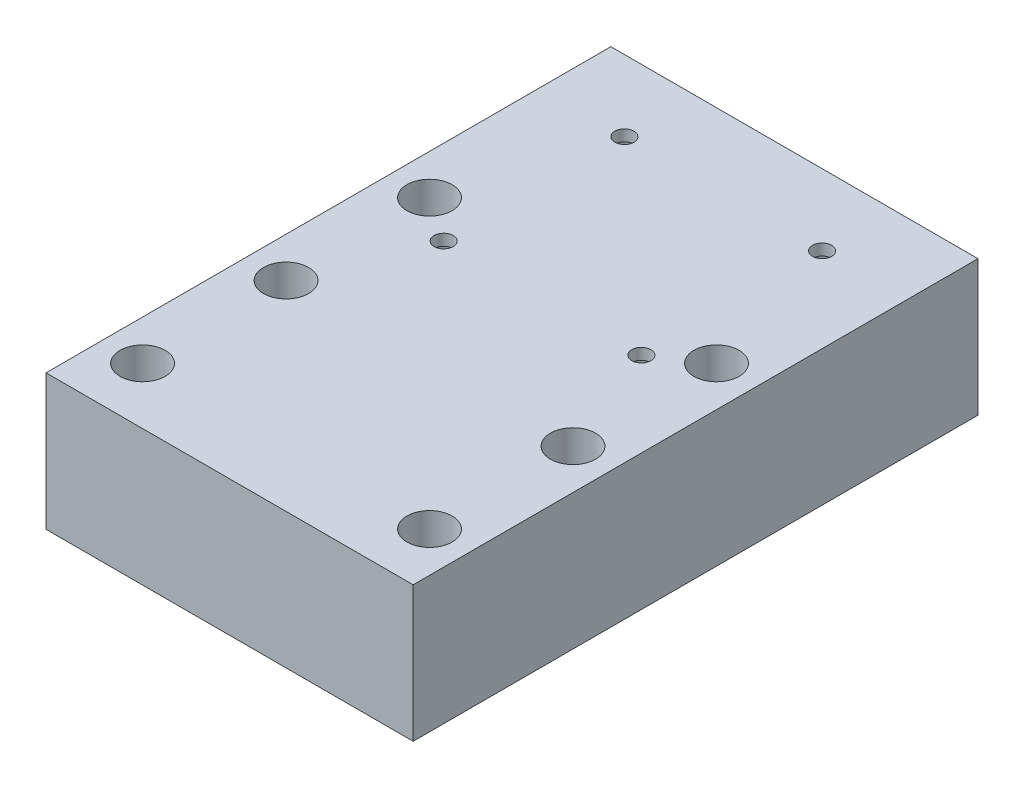
ISO-10303-21;
HEADER;
FILE_DESCRIPTION(('STEP AP214'),'2;1');
FILE_NAME('part.step','',(''),(''),'','','');
FILE_SCHEMA(('AUTOMOTIVE_DESIGN { 1 0 10303 214 1 1 1 1 }'));
ENDSEC;
DATA;
#1=APPLICATION_CONTEXT('core data for automotive mechanical design processes');
#2=APPLICATION_PROTOCOL_DEFINITION('international standard','automotive_design',2000,#1);
#3=PRODUCT_CONTEXT('',#1,'mechanical');
#4=PRODUCT('Part','Part','',(#3));
#5=PRODUCT_RELATED_PRODUCT_CATEGORY('part','',(#4));
#6=PRODUCT_DEFINITION_FORMATION('','',#4);
#7=PRODUCT_DEFINITION_CONTEXT('part definition',#1,'design');
#8=PRODUCT_DEFINITION('design','',#6,#7);
#9=PRODUCT_DEFINITION_SHAPE('','',#8);
#10=(LENGTH_UNIT() NAMED_UNIT(*) SI_UNIT(.MILLI.,.METRE.));
#11=(NAMED_UNIT(*) PLANE_ANGLE_UNIT() SI_UNIT($,.RADIAN.));
#12=(NAMED_UNIT(*) SI_UNIT($,.STERADIAN.) SOLID_ANGLE_UNIT());
#13=UNCERTAINTY_MEASURE_WITH_UNIT(LENGTH_MEASURE(1.E-05),#10,'distance_accuracy_value','');
#14=(GEOMETRIC_REPRESENTATION_CONTEXT(3) GLOBAL_UNCERTAINTY_ASSIGNED_CONTEXT((#13)) GLOBAL_UNIT_ASSIGNED_CONTEXT((#10,
#11,#12)) REPRESENTATION_CONTEXT('',''));
#15=CARTESIAN_POINT('',(0.,0.,0.));
#16=DIRECTION('',(0.,0.,1.));
#17=DIRECTION('',(1.,0.,0.));
#18=AXIS2_PLACEMENT_3D('',#15,#16,#17);
#19=CARTESIAN_POINT('',(17.5,24.,-37.4));
#20=DIRECTION('',(0.,-1.,0.));
#21=DIRECTION('',(0.,0.,-1.));
#22=AXIS2_PLACEMENT_3D('',#19,#20,#21);
#23=CYLINDRICAL_SURFACE('',#22,1.7);
#24=CARTESIAN_POINT('',(17.5,24.,-37.4));
#25=DIRECTION('',(0.,1.,0.));
#26=DIRECTION('',(0.,0.,-1.));
#27=AXIS2_PLACEMENT_3D('',#24,#25,#26);
#28=CIRCLE('',#27,1.7);
#29=CARTESIAN_POINT('',(17.5,24.,-39.1));
#30=VERTEX_POINT('',#29);
#31=EDGE_CURVE('E158',#30,#30,#28,.T.);
#32=ORIENTED_EDGE('',*,*,#31,.T.);
#33=EDGE_LOOP('',(#32));
#34=FACE_BOUND('',#33,.T.);
#35=CARTESIAN_POINT('',(17.5,22.,-37.4));
#36=DIRECTION('',(0.,-1.,0.));
#37=DIRECTION('',(0.,0.,-1.));
#38=AXIS2_PLACEMENT_3D('',#35,#36,#37);
#39=CIRCLE('',#38,1.7);
#40=CARTESIAN_POINT('',(17.5,22.,-39.1));
#41=VERTEX_POINT('',#40);
#42=EDGE_CURVE('E37',#41,#41,#39,.T.);
#43=ORIENTED_EDGE('',*,*,#42,.T.);
#44=EDGE_LOOP('',(#43));
#45=FACE_BOUND('',#44,.T.);
#46=ADVANCED_FACE('F33',(#34,#45),#23,.F.);
#47=CARTESIAN_POINT('',(-17.5,24.,-37.4));
#48=DIRECTION('',(0.,-1.,0.));
#49=DIRECTION('',(0.,0.,-1.));
#50=AXIS2_PLACEMENT_3D('',#47,#48,#49);
#51=CYLINDRICAL_SURFACE('',#50,1.7);
#52=CARTESIAN_POINT('',(-17.5,24.,-37.4));
#53=DIRECTION('',(0.,1.,0.));
#54=DIRECTION('',(0.,0.,1.));
#55=AXIS2_PLACEMENT_3D('',#52,#53,#54);
#56=CIRCLE('',#55,1.7);
#57=CARTESIAN_POINT('',(-17.5,24.,-35.7));
#58=VERTEX_POINT('',#57);
#59=EDGE_CURVE('E161',#58,#58,#56,.T.);
#60=ORIENTED_EDGE('',*,*,#59,.T.);
#61=EDGE_LOOP('',(#60));
#62=FACE_BOUND('',#61,.T.);
#63=CARTESIAN_POINT('',(-17.5,22.,-37.4));
#64=DIRECTION('',(0.,-1.,0.));
#65=DIRECTION('',(0.,0.,-1.));
#66=AXIS2_PLACEMENT_3D('',#63,#64,#65);
#67=CIRCLE('',#66,1.7);
#68=CARTESIAN_POINT('',(-17.5,22.,-39.1));
#69=VERTEX_POINT('',#68);
#70=EDGE_CURVE('E119',#69,#69,#67,.T.);
#71=ORIENTED_EDGE('',*,*,#70,.T.);
#72=EDGE_LOOP('',(#71));
#73=FACE_BOUND('',#72,.T.);
#74=ADVANCED_FACE('F210',(#62,#73),#51,.F.);
#75=CARTESIAN_POINT('',(17.5,24.,-5.39999999999998));
#76=DIRECTION('',(0.,-1.,0.));
#77=DIRECTION('',(0.,0.,-1.));
#78=AXIS2_PLACEMENT_3D('',#75,#76,#77);
#79=CYLINDRICAL_SURFACE('',#78,1.7);
#80=CARTESIAN_POINT('',(17.5,24.,-5.39999999999998));
#81=DIRECTION('',(0.,1.,0.));
#82=DIRECTION('',(0.,0.,-1.));
#83=AXIS2_PLACEMENT_3D('',#80,#81,#82);
#84=CIRCLE('',#83,1.7);
#85=CARTESIAN_POINT('',(17.5,24.,-7.09999999999998));
#86=VERTEX_POINT('',#85);
#87=EDGE_CURVE('E153',#86,#86,#84,.T.);
#88=ORIENTED_EDGE('',*,*,#87,.T.);
#89=EDGE_LOOP('',(#88));
#90=FACE_BOUND('',#89,.T.);
#91=CARTESIAN_POINT('',(17.5,22.,-5.39999999999998));
#92=DIRECTION('',(0.,-1.,0.));
#93=DIRECTION('',(0.,0.,-1.));
#94=AXIS2_PLACEMENT_3D('',#91,#92,#93);
#95=CIRCLE('',#94,1.7);
#96=CARTESIAN_POINT('',(17.5,22.,-7.09999999999998));
#97=VERTEX_POINT('',#96);
#98=EDGE_CURVE('E115',#97,#97,#95,.T.);
#99=ORIENTED_EDGE('',*,*,#98,.T.);
#100=EDGE_LOOP('',(#99));
#101=FACE_BOUND('',#100,.T.);
#102=ADVANCED_FACE('F216',(#90,#101),#79,.F.);
#103=CARTESIAN_POINT('',(-17.5,24.,-5.39999999999998));
#104=DIRECTION('',(0.,-1.,0.));
#105=DIRECTION('',(0.,0.,-1.));
#106=AXIS2_PLACEMENT_3D('',#103,#104,#105);
#107=CYLINDRICAL_SURFACE('',#106,1.7);
#108=CARTESIAN_POINT('',(-17.5,24.,-5.39999999999998));
#109=DIRECTION('',(0.,1.,0.));
#110=DIRECTION('',(0.,0.,1.));
#111=AXIS2_PLACEMENT_3D('',#108,#109,#110);
#112=CIRCLE('',#111,1.7);
#113=CARTESIAN_POINT('',(-17.5,24.,-3.69999999999998));
#114=VERTEX_POINT('',#113);
#115=EDGE_CURVE('E164',#114,#114,#112,.T.);
#116=ORIENTED_EDGE('',*,*,#115,.T.);
#117=EDGE_LOOP('',(#116));
#118=FACE_BOUND('',#117,.T.);
#119=CARTESIAN_POINT('',(-17.5,22.,-5.39999999999998));
#120=DIRECTION('',(0.,-1.,0.));
#121=DIRECTION('',(0.,0.,-1.));
#122=AXIS2_PLACEMENT_3D('',#119,#120,#121);
#123=CIRCLE('',#122,1.7);
#124=CARTESIAN_POINT('',(-17.5,22.,-7.09999999999998));
#125=VERTEX_POINT('',#124);
#126=EDGE_CURVE('E110',#125,#125,#123,.T.);
#127=ORIENTED_EDGE('',*,*,#126,.T.);
#128=EDGE_LOOP('',(#127));
#129=FACE_BOUND('',#128,.T.);
#130=ADVANCED_FACE('F223',(#118,#129),#107,.F.);
#131=CARTESIAN_POINT('',(0.,24.,0.));
#132=DIRECTION('',(0.,1.,0.));
#133=DIRECTION('',(0.,0.,1.));
#134=AXIS2_PLACEMENT_3D('',#131,#132,#133);
#135=PLANE('',#134);
#136=CARTESIAN_POINT('',(-25.4000000000002,24.,-10.8));
#137=DIRECTION('',(0.,1.,0.));
#138=DIRECTION('',(0.,0.,1.));
#139=AXIS2_PLACEMENT_3D('',#136,#137,#138);
#140=CIRCLE('',#139,4.);
#141=CARTESIAN_POINT('',(-25.4000000000002,24.,-6.79999999999998));
#142=VERTEX_POINT('',#141);
#143=EDGE_CURVE('E150',#142,#142,#140,.T.);
#144=ORIENTED_EDGE('',*,*,#143,.F.);
#145=EDGE_LOOP('',(#144));
#146=FACE_BOUND('',#145,.T.);
#147=ORIENTED_EDGE('',*,*,#31,.F.);
#148=EDGE_LOOP('',(#147));
#149=FACE_BOUND('',#148,.T.);
#150=ORIENTED_EDGE('',*,*,#115,.F.);
#151=EDGE_LOOP('',(#150));
#152=FACE_BOUND('',#151,.T.);
#153=CARTESIAN_POINT('',(-25.4000000000001,24.,14.6));
#154=DIRECTION('',(0.,1.,0.));
#155=DIRECTION('',(0.,0.,1.));
#156=AXIS2_PLACEMENT_3D('',#153,#154,#155);
#157=CIRCLE('',#156,4.);
#158=CARTESIAN_POINT('',(-25.4000000000001,24.,18.6));
#159=VERTEX_POINT('',#158);
#160=EDGE_CURVE('E174',#159,#159,#157,.T.);
#161=ORIENTED_EDGE('',*,*,#160,.F.);
#162=EDGE_LOOP('',(#161));
#163=FACE_BOUND('',#162,.T.);
#164=CARTESIAN_POINT('',(-25.4,24.,40.));
#165=DIRECTION('',(0.,1.,0.));
#166=DIRECTION('',(0.,0.,1.));
#167=AXIS2_PLACEMENT_3D('',#164,#165,#166);
#168=CIRCLE('',#167,4.);
#169=CARTESIAN_POINT('',(-25.4,24.,44.));
#170=VERTEX_POINT('',#169);
#171=EDGE_CURVE('E104',#170,#170,#168,.T.);
#172=ORIENTED_EDGE('',*,*,#171,.F.);
#173=EDGE_LOOP('',(#172));
#174=FACE_BOUND('',#173,.T.);
#175=DIRECTION('',(0.,0.,-1.));
#176=VECTOR('',#175,1.);
#177=CARTESIAN_POINT('',(32.5,24.,-50.));
#178=LINE('',#177,#176);
#179=CARTESIAN_POINT('',(32.5,24.,50.));
#180=VERTEX_POINT('',#179);
#181=CARTESIAN_POINT('',(32.5,24.,-50.));
#182=VERTEX_POINT('',#181);
#183=EDGE_CURVE('E88',#180,#182,#178,.T.);
#184=ORIENTED_EDGE('',*,*,#183,.T.);
#185=DIRECTION('',(-1.,0.,0.));
#186=VECTOR('',#185,1.);
#187=CARTESIAN_POINT('',(-32.5,24.,-50.));
#188=LINE('',#187,#186);
#189=CARTESIAN_POINT('',(-32.5,24.,-50.));
#190=VERTEX_POINT('',#189);
#191=EDGE_CURVE('E82',#182,#190,#188,.T.);
#192=ORIENTED_EDGE('',*,*,#191,.T.);
#193=DIRECTION('',(0.,0.,1.));
#194=VECTOR('',#193,1.);
#195=CARTESIAN_POINT('',(-32.5,24.,-50.));
#196=LINE('',#195,#194);
#197=CARTESIAN_POINT('',(-32.5,24.,50.));
#198=VERTEX_POINT('',#197);
#199=EDGE_CURVE('E86',#190,#198,#196,.T.);
#200=ORIENTED_EDGE('',*,*,#199,.T.);
#201=DIRECTION('',(1.,0.,0.));
#202=VECTOR('',#201,1.);
#203=CARTESIAN_POINT('',(-32.5,24.,50.));
#204=LINE('',#203,#202);
#205=EDGE_CURVE('E52',#198,#180,#204,.T.);
#206=ORIENTED_EDGE('',*,*,#205,.T.);
#207=EDGE_LOOP('',(#184,#192,#200,#206));
#208=FACE_BOUND('',#207,.T.);
#209=CARTESIAN_POINT('',(25.4,24.,40.));
#210=DIRECTION('',(0.,1.,0.));
#211=DIRECTION('',(0.,0.,1.));
#212=AXIS2_PLACEMENT_3D('',#209,#210,#211);
#213=CIRCLE('',#212,4.);
#214=CARTESIAN_POINT('',(25.4,24.,44.));
#215=VERTEX_POINT('',#214);
#216=EDGE_CURVE('E180',#215,#215,#213,.T.);
#217=ORIENTED_EDGE('',*,*,#216,.F.);
#218=EDGE_LOOP('',(#217));
#219=FACE_BOUND('',#218,.T.);
#220=CARTESIAN_POINT('',(25.3999999999999,24.,14.6));
#221=DIRECTION('',(0.,1.,0.));
#222=DIRECTION('',(0.,0.,1.));
#223=AXIS2_PLACEMENT_3D('',#220,#221,#222);
#224=CIRCLE('',#223,4.);
#225=CARTESIAN_POINT('',(25.3999999999999,24.,18.6));
#226=VERTEX_POINT('',#225);
#227=EDGE_CURVE('E168',#226,#226,#224,.T.);
#228=ORIENTED_EDGE('',*,*,#227,.F.);
#229=EDGE_LOOP('',(#228));
#230=FACE_BOUND('',#229,.T.);
#231=ORIENTED_EDGE('',*,*,#59,.F.);
#232=EDGE_LOOP('',(#231));
#233=FACE_BOUND('',#232,.T.);
#234=ORIENTED_EDGE('',*,*,#87,.F.);
#235=EDGE_LOOP('',(#234));
#236=FACE_BOUND('',#235,.T.);
#237=CARTESIAN_POINT('',(25.3999999999998,24.,-10.8));
#238=DIRECTION('',(0.,1.,0.));
#239=DIRECTION('',(0.,0.,1.));
#240=AXIS2_PLACEMENT_3D('',#237,#238,#239);
#241=CIRCLE('',#240,4.);
#242=CARTESIAN_POINT('',(25.3999999999998,24.,-6.79999999999998));
#243=VERTEX_POINT('',#242);
#244=EDGE_CURVE('E144',#243,#243,#241,.T.);
#245=ORIENTED_EDGE('',*,*,#244,.F.);
#246=EDGE_LOOP('',(#245));
#247=FACE_BOUND('',#246,.T.);
#248=ADVANCED_FACE('F83',(#146,#149,#152,#163,#174,#208,#219,#230,#233,#236,#247),#135,.T.);
#249=CARTESIAN_POINT('',(0.,0.,0.));
#250=DIRECTION('',(0.,1.,0.));
#251=DIRECTION('',(0.,0.,1.));
#252=AXIS2_PLACEMENT_3D('',#249,#250,#251);
#253=PLANE('',#252);
#254=CARTESIAN_POINT('',(17.5,0.,-37.4));
#255=DIRECTION('',(0.,-1.,0.));
#256=DIRECTION('',(0.,0.,-1.));
#257=AXIS2_PLACEMENT_3D('',#254,#255,#256);
#258=CIRCLE('',#257,3.5);
#259=CARTESIAN_POINT('',(17.5,0.,-40.9));
#260=VERTEX_POINT('',#259);
#261=EDGE_CURVE('E135',#260,#260,#258,.T.);
#262=ORIENTED_EDGE('',*,*,#261,.F.);
#263=EDGE_LOOP('',(#262));
#264=FACE_BOUND('',#263,.T.);
#265=CARTESIAN_POINT('',(-17.5,0.,-37.4));
#266=DIRECTION('',(0.,-1.,0.));
#267=DIRECTION('',(0.,0.,-1.));
#268=AXIS2_PLACEMENT_3D('',#265,#266,#267);
#269=CIRCLE('',#268,3.5);
#270=CARTESIAN_POINT('',(-17.5,0.,-40.9));
#271=VERTEX_POINT('',#270);
#272=EDGE_CURVE('E128',#271,#271,#269,.T.);
#273=ORIENTED_EDGE('',*,*,#272,.F.);
#274=EDGE_LOOP('',(#273));
#275=FACE_BOUND('',#274,.T.);
#276=CARTESIAN_POINT('',(17.5,0.,-5.39999999999998));
#277=DIRECTION('',(0.,-1.,0.));
#278=DIRECTION('',(0.,0.,-1.));
#279=AXIS2_PLACEMENT_3D('',#276,#277,#278);
#280=CIRCLE('',#279,3.5);
#281=CARTESIAN_POINT('',(17.5,0.,-8.89999999999998));
#282=VERTEX_POINT('',#281);
#283=EDGE_CURVE('E121',#282,#282,#280,.T.);
#284=ORIENTED_EDGE('',*,*,#283,.F.);
#285=EDGE_LOOP('',(#284));
#286=FACE_BOUND('',#285,.T.);
#287=CARTESIAN_POINT('',(-17.5,0.,-5.39999999999998));
#288=DIRECTION('',(0.,-1.,0.));
#289=DIRECTION('',(0.,0.,-1.));
#290=AXIS2_PLACEMENT_3D('',#287,#288,#289);
#291=CIRCLE('',#290,3.5);
#292=CARTESIAN_POINT('',(-17.5,0.,-8.89999999999998));
#293=VERTEX_POINT('',#292);
#294=EDGE_CURVE('E117',#293,#293,#291,.T.);
#295=ORIENTED_EDGE('',*,*,#294,.F.);
#296=EDGE_LOOP('',(#295));
#297=FACE_BOUND('',#296,.T.);
#298=DIRECTION('',(0.,0.,-1.));
#299=VECTOR('',#298,1.);
#300=CARTESIAN_POINT('',(32.5,0.,-50.));
#301=LINE('',#300,#299);
#302=CARTESIAN_POINT('',(32.5,0.,50.));
#303=VERTEX_POINT('',#302);
#304=CARTESIAN_POINT('',(32.5,0.,-50.));
#305=VERTEX_POINT('',#304);
#306=EDGE_CURVE('E101',#303,#305,#301,.T.);
#307=ORIENTED_EDGE('',*,*,#306,.F.);
#308=DIRECTION('',(1.,0.,0.));
#309=VECTOR('',#308,1.);
#310=CARTESIAN_POINT('',(-32.5,0.,50.));
#311=LINE('',#310,#309);
#312=CARTESIAN_POINT('',(-32.5,0.,50.));
#313=VERTEX_POINT('',#312);
#314=EDGE_CURVE('E75',#313,#303,#311,.T.);
#315=ORIENTED_EDGE('',*,*,#314,.F.);
#316=DIRECTION('',(0.,0.,1.));
#317=VECTOR('',#316,1.);
#318=CARTESIAN_POINT('',(-32.5,0.,-50.));
#319=LINE('',#318,#317);
#320=CARTESIAN_POINT('',(-32.5,0.,-50.));
#321=VERTEX_POINT('',#320);
#322=EDGE_CURVE('E69',#321,#313,#319,.T.);
#323=ORIENTED_EDGE('',*,*,#322,.F.);
#324=DIRECTION('',(-1.,0.,0.));
#325=VECTOR('',#324,1.);
#326=CARTESIAN_POINT('',(-32.5,0.,-50.));
#327=LINE('',#326,#325);
#328=EDGE_CURVE('E92',#305,#321,#327,.T.);
#329=ORIENTED_EDGE('',*,*,#328,.F.);
#330=EDGE_LOOP('',(#307,#315,#323,#329));
#331=FACE_BOUND('',#330,.T.);
#332=CARTESIAN_POINT('',(-25.4,0.,40.));
#333=DIRECTION('',(0.,1.,0.));
#334=DIRECTION('',(0.,0.,1.));
#335=AXIS2_PLACEMENT_3D('',#332,#333,#334);
#336=CIRCLE('',#335,4.);
#337=CARTESIAN_POINT('',(-25.4,0.,44.));
#338=VERTEX_POINT('',#337);
#339=EDGE_CURVE('E183',#338,#338,#336,.T.);
#340=ORIENTED_EDGE('',*,*,#339,.T.);
#341=EDGE_LOOP('',(#340));
#342=FACE_BOUND('',#341,.T.);
#343=CARTESIAN_POINT('',(25.4,0.,40.));
#344=DIRECTION('',(0.,1.,0.));
#345=DIRECTION('',(0.,0.,1.));
#346=AXIS2_PLACEMENT_3D('',#343,#344,#345);
#347=CIRCLE('',#346,4.);
#348=CARTESIAN_POINT('',(25.4,0.,44.));
#349=VERTEX_POINT('',#348);
#350=EDGE_CURVE('E177',#349,#349,#347,.T.);
#351=ORIENTED_EDGE('',*,*,#350,.T.);
#352=EDGE_LOOP('',(#351));
#353=FACE_BOUND('',#352,.T.);
#354=CARTESIAN_POINT('',(-25.4000000000001,0.,14.6));
#355=DIRECTION('',(0.,1.,0.));
#356=DIRECTION('',(0.,0.,1.));
#357=AXIS2_PLACEMENT_3D('',#354,#355,#356);
#358=CIRCLE('',#357,4.);
#359=CARTESIAN_POINT('',(-25.4000000000001,0.,18.6));
#360=VERTEX_POINT('',#359);
#361=EDGE_CURVE('E171',#360,#360,#358,.T.);
#362=ORIENTED_EDGE('',*,*,#361,.T.);
#363=EDGE_LOOP('',(#362));
#364=FACE_BOUND('',#363,.T.);
#365=CARTESIAN_POINT('',(25.3999999999999,0.,14.6));
#366=DIRECTION('',(0.,1.,0.));
#367=DIRECTION('',(0.,0.,1.));
#368=AXIS2_PLACEMENT_3D('',#365,#366,#367);
#369=CIRCLE('',#368,4.);
#370=CARTESIAN_POINT('',(25.3999999999999,0.,18.6));
#371=VERTEX_POINT('',#370);
#372=EDGE_CURVE('E167',#371,#371,#369,.T.);
#373=ORIENTED_EDGE('',*,*,#372,.T.);
#374=EDGE_LOOP('',(#373));
#375=FACE_BOUND('',#374,.T.);
#376=CARTESIAN_POINT('',(-25.4000000000002,0.,-10.8));
#377=DIRECTION('',(0.,1.,0.));
#378=DIRECTION('',(0.,0.,1.));
#379=AXIS2_PLACEMENT_3D('',#376,#377,#378);
#380=CIRCLE('',#379,4.);
#381=CARTESIAN_POINT('',(-25.4000000000002,0.,-6.79999999999998));
#382=VERTEX_POINT('',#381);
#383=EDGE_CURVE('E147',#382,#382,#380,.T.);
#384=ORIENTED_EDGE('',*,*,#383,.T.);
#385=EDGE_LOOP('',(#384));
#386=FACE_BOUND('',#385,.T.);
#387=CARTESIAN_POINT('',(25.3999999999998,0.,-10.8));
#388=DIRECTION('',(0.,1.,0.));
#389=DIRECTION('',(0.,0.,1.));
#390=AXIS2_PLACEMENT_3D('',#387,#388,#389);
#391=CIRCLE('',#390,4.);
#392=CARTESIAN_POINT('',(25.3999999999998,0.,-6.79999999999998));
#393=VERTEX_POINT('',#392);
#394=EDGE_CURVE('E113',#393,#393,#391,.T.);
#395=ORIENTED_EDGE('',*,*,#394,.T.);
#396=EDGE_LOOP('',(#395));
#397=FACE_BOUND('',#396,.T.);
#398=ADVANCED_FACE('F191',(#264,#275,#286,#297,#331,#342,#353,#364,#375,#386,#397),#253,.F.);
#399=CARTESIAN_POINT('',(32.5,24.,-50.));
#400=DIRECTION('',(-1.,0.,0.));
#401=DIRECTION('',(0.,0.,1.));
#402=AXIS2_PLACEMENT_3D('',#399,#400,#401);
#403=PLANE('',#402);
#404=ORIENTED_EDGE('',*,*,#306,.T.);
#405=DIRECTION('',(0.,-1.,0.));
#406=VECTOR('',#405,1.);
#407=CARTESIAN_POINT('',(32.5,24.,-50.));
#408=LINE('',#407,#406);
#409=EDGE_CURVE('E11',#182,#305,#408,.T.);
#410=ORIENTED_EDGE('',*,*,#409,.F.);
#411=ORIENTED_EDGE('',*,*,#183,.F.);
#412=DIRECTION('',(0.,-1.,0.));
#413=VECTOR('',#412,1.);
#414=CARTESIAN_POINT('',(32.5,24.,50.));
#415=LINE('',#414,#413);
#416=EDGE_CURVE('E97',#180,#303,#415,.T.);
#417=ORIENTED_EDGE('',*,*,#416,.T.);
#418=EDGE_LOOP('',(#404,#410,#411,#417));
#419=FACE_BOUND('',#418,.T.);
#420=ADVANCED_FACE('F35',(#419),#403,.F.);
#421=CARTESIAN_POINT('',(-32.5,24.,-50.));
#422=DIRECTION('',(0.,0.,1.));
#423=DIRECTION('',(1.,0.,0.));
#424=AXIS2_PLACEMENT_3D('',#421,#422,#423);
#425=PLANE('',#424);
#426=ORIENTED_EDGE('',*,*,#328,.T.);
#427=DIRECTION('',(0.,-1.,0.));
#428=VECTOR('',#427,1.);
#429=CARTESIAN_POINT('',(-32.5,24.,-50.));
#430=LINE('',#429,#428);
#431=EDGE_CURVE('E43',#190,#321,#430,.T.);
#432=ORIENTED_EDGE('',*,*,#431,.F.);
#433=ORIENTED_EDGE('',*,*,#191,.F.);
#434=ORIENTED_EDGE('',*,*,#409,.T.);
#435=EDGE_LOOP('',(#426,#432,#433,#434));
#436=FACE_BOUND('',#435,.T.);
#437=ADVANCED_FACE('F91',(#436),#425,.F.);
#438=CARTESIAN_POINT('',(-32.5,24.,-50.));
#439=DIRECTION('',(1.,0.,0.));
#440=DIRECTION('',(0.,0.,-1.));
#441=AXIS2_PLACEMENT_3D('',#438,#439,#440);
#442=PLANE('',#441);
#443=ORIENTED_EDGE('',*,*,#322,.T.);
#444=DIRECTION('',(0.,-1.,0.));
#445=VECTOR('',#444,1.);
#446=CARTESIAN_POINT('',(-32.5,24.,50.));
#447=LINE('',#446,#445);
#448=EDGE_CURVE('E93',#198,#313,#447,.T.);
#449=ORIENTED_EDGE('',*,*,#448,.F.);
#450=ORIENTED_EDGE('',*,*,#199,.F.);
#451=ORIENTED_EDGE('',*,*,#431,.T.);
#452=EDGE_LOOP('',(#443,#449,#450,#451));
#453=FACE_BOUND('',#452,.T.);
#454=ADVANCED_FACE('F95',(#453),#442,.F.);
#455=CARTESIAN_POINT('',(-32.5,24.,50.));
#456=DIRECTION('',(0.,0.,-1.));
#457=DIRECTION('',(-1.,0.,0.));
#458=AXIS2_PLACEMENT_3D('',#455,#456,#457);
#459=PLANE('',#458);
#460=ORIENTED_EDGE('',*,*,#314,.T.);
#461=ORIENTED_EDGE('',*,*,#416,.F.);
#462=ORIENTED_EDGE('',*,*,#205,.F.);
#463=ORIENTED_EDGE('',*,*,#448,.T.);
#464=EDGE_LOOP('',(#460,#461,#462,#463));
#465=FACE_BOUND('',#464,.T.);
#466=ADVANCED_FACE('F197',(#465),#459,.F.);
#467=CARTESIAN_POINT('',(-25.4,24.,40.));
#468=DIRECTION('',(0.,-1.,0.));
#469=DIRECTION('',(0.,0.,-1.));
#470=AXIS2_PLACEMENT_3D('',#467,#468,#469);
#471=CYLINDRICAL_SURFACE('',#470,4.);
#472=ORIENTED_EDGE('',*,*,#171,.T.);
#473=EDGE_LOOP('',(#472));
#474=FACE_BOUND('',#473,.T.);
#475=ORIENTED_EDGE('',*,*,#339,.F.);
#476=EDGE_LOOP('',(#475));
#477=FACE_BOUND('',#476,.T.);
#478=ADVANCED_FACE('F194',(#474,#477),#471,.F.);
#479=CARTESIAN_POINT('',(25.4,24.,40.));
#480=DIRECTION('',(0.,-1.,0.));
#481=DIRECTION('',(0.,0.,-1.));
#482=AXIS2_PLACEMENT_3D('',#479,#480,#481);
#483=CYLINDRICAL_SURFACE('',#482,4.);
#484=ORIENTED_EDGE('',*,*,#216,.T.);
#485=EDGE_LOOP('',(#484));
#486=FACE_BOUND('',#485,.T.);
#487=ORIENTED_EDGE('',*,*,#350,.F.);
#488=EDGE_LOOP('',(#487));
#489=FACE_BOUND('',#488,.T.);
#490=ADVANCED_FACE('F196',(#486,#489),#483,.F.);
#491=CARTESIAN_POINT('',(-25.4000000000001,24.,14.6));
#492=DIRECTION('',(0.,-1.,0.));
#493=DIRECTION('',(0.,0.,-1.));
#494=AXIS2_PLACEMENT_3D('',#491,#492,#493);
#495=CYLINDRICAL_SURFACE('',#494,4.);
#496=ORIENTED_EDGE('',*,*,#160,.T.);
#497=EDGE_LOOP('',(#496));
#498=FACE_BOUND('',#497,.T.);
#499=ORIENTED_EDGE('',*,*,#361,.F.);
#500=EDGE_LOOP('',(#499));
#501=FACE_BOUND('',#500,.T.);
#502=ADVANCED_FACE('F204',(#498,#501),#495,.F.);
#503=CARTESIAN_POINT('',(25.3999999999999,24.,14.6));
#504=DIRECTION('',(0.,-1.,0.));
#505=DIRECTION('',(0.,0.,-1.));
#506=AXIS2_PLACEMENT_3D('',#503,#504,#505);
#507=CYLINDRICAL_SURFACE('',#506,4.);
#508=ORIENTED_EDGE('',*,*,#227,.T.);
#509=EDGE_LOOP('',(#508));
#510=FACE_BOUND('',#509,.T.);
#511=ORIENTED_EDGE('',*,*,#372,.F.);
#512=EDGE_LOOP('',(#511));
#513=FACE_BOUND('',#512,.T.);
#514=ADVANCED_FACE('F227',(#510,#513),#507,.F.);
#515=CARTESIAN_POINT('',(-25.4000000000002,24.,-10.8));
#516=DIRECTION('',(0.,-1.,0.));
#517=DIRECTION('',(0.,0.,-1.));
#518=AXIS2_PLACEMENT_3D('',#515,#516,#517);
#519=CYLINDRICAL_SURFACE('',#518,4.);
#520=ORIENTED_EDGE('',*,*,#143,.T.);
#521=EDGE_LOOP('',(#520));
#522=FACE_BOUND('',#521,.T.);
#523=ORIENTED_EDGE('',*,*,#383,.F.);
#524=EDGE_LOOP('',(#523));
#525=FACE_BOUND('',#524,.T.);
#526=ADVANCED_FACE('F230',(#522,#525),#519,.F.);
#527=CARTESIAN_POINT('',(25.3999999999998,24.,-10.8));
#528=DIRECTION('',(0.,-1.,0.));
#529=DIRECTION('',(0.,0.,-1.));
#530=AXIS2_PLACEMENT_3D('',#527,#528,#529);
#531=CYLINDRICAL_SURFACE('',#530,4.);
#532=ORIENTED_EDGE('',*,*,#244,.T.);
#533=EDGE_LOOP('',(#532));
#534=FACE_BOUND('',#533,.T.);
#535=ORIENTED_EDGE('',*,*,#394,.F.);
#536=EDGE_LOOP('',(#535));
#537=FACE_BOUND('',#536,.T.);
#538=ADVANCED_FACE('F250',(#534,#537),#531,.F.);
#539=CARTESIAN_POINT('',(-17.5,22.,-5.39999999999998));
#540=DIRECTION('',(0.,-1.,0.));
#541=DIRECTION('',(0.,0.,-1.));
#542=AXIS2_PLACEMENT_3D('',#539,#540,#541);
#543=CYLINDRICAL_SURFACE('',#542,3.5);
#544=CARTESIAN_POINT('',(-17.5,22.,-5.39999999999998));
#545=DIRECTION('',(0.,-1.,0.));
#546=DIRECTION('',(0.,0.,-1.));
#547=AXIS2_PLACEMENT_3D('',#544,#545,#546);
#548=CIRCLE('',#547,3.5);
#549=CARTESIAN_POINT('',(-17.5,22.,-8.89999999999998));
#550=VERTEX_POINT('',#549);
#551=EDGE_CURVE('E114',#550,#550,#548,.T.);
#552=ORIENTED_EDGE('',*,*,#551,.F.);
#553=EDGE_LOOP('',(#552));
#554=FACE_BOUND('',#553,.T.);
#555=ORIENTED_EDGE('',*,*,#294,.T.);
#556=EDGE_LOOP('',(#555));
#557=FACE_BOUND('',#556,.T.);
#558=ADVANCED_FACE('F252',(#554,#557),#543,.F.);
#559=CARTESIAN_POINT('',(-17.5,22.,-5.39999999999998));
#560=DIRECTION('',(0.,-1.,0.));
#561=DIRECTION('',(0.,0.,-1.));
#562=AXIS2_PLACEMENT_3D('',#559,#560,#561);
#563=PLANE('',#562);
#564=ORIENTED_EDGE('',*,*,#126,.F.);
#565=EDGE_LOOP('',(#564));
#566=FACE_BOUND('',#565,.T.);
#567=ORIENTED_EDGE('',*,*,#551,.T.);
#568=EDGE_LOOP('',(#567));
#569=FACE_BOUND('',#568,.T.);
#570=ADVANCED_FACE('F259',(#566,#569),#563,.T.);
#571=CARTESIAN_POINT('',(17.5,22.,-5.39999999999998));
#572=DIRECTION('',(0.,-1.,0.));
#573=DIRECTION('',(0.,0.,-1.));
#574=AXIS2_PLACEMENT_3D('',#571,#572,#573);
#575=CYLINDRICAL_SURFACE('',#574,3.5);
#576=CARTESIAN_POINT('',(17.5,22.,-5.39999999999998));
#577=DIRECTION('',(0.,-1.,0.));
#578=DIRECTION('',(0.,0.,-1.));
#579=AXIS2_PLACEMENT_3D('',#576,#577,#578);
#580=CIRCLE('',#579,3.5);
#581=CARTESIAN_POINT('',(17.5,22.,-8.89999999999998));
#582=VERTEX_POINT('',#581);
#583=EDGE_CURVE('E118',#582,#582,#580,.T.);
#584=ORIENTED_EDGE('',*,*,#583,.F.);
#585=EDGE_LOOP('',(#584));
#586=FACE_BOUND('',#585,.T.);
#587=ORIENTED_EDGE('',*,*,#283,.T.);
#588=EDGE_LOOP('',(#587));
#589=FACE_BOUND('',#588,.T.);
#590=ADVANCED_FACE('F266',(#586,#589),#575,.F.);
#591=CARTESIAN_POINT('',(17.5,22.,-5.39999999999998));
#592=DIRECTION('',(0.,-1.,0.));
#593=DIRECTION('',(0.,0.,-1.));
#594=AXIS2_PLACEMENT_3D('',#591,#592,#593);
#595=PLANE('',#594);
#596=ORIENTED_EDGE('',*,*,#98,.F.);
#597=EDGE_LOOP('',(#596));
#598=FACE_BOUND('',#597,.T.);
#599=ORIENTED_EDGE('',*,*,#583,.T.);
#600=EDGE_LOOP('',(#599));
#601=FACE_BOUND('',#600,.T.);
#602=ADVANCED_FACE('F270',(#598,#601),#595,.T.);
#603=CARTESIAN_POINT('',(-17.5,22.,-37.4));
#604=DIRECTION('',(0.,-1.,0.));
#605=DIRECTION('',(0.,0.,-1.));
#606=AXIS2_PLACEMENT_3D('',#603,#604,#605);
#607=CYLINDRICAL_SURFACE('',#606,3.5);
#608=CARTESIAN_POINT('',(-17.5,22.,-37.4));
#609=DIRECTION('',(0.,-1.,0.));
#610=DIRECTION('',(0.,0.,-1.));
#611=AXIS2_PLACEMENT_3D('',#608,#609,#610);
#612=CIRCLE('',#611,3.5);
#613=CARTESIAN_POINT('',(-17.5,22.,-40.9));
#614=VERTEX_POINT('',#613);
#615=EDGE_CURVE('E122',#614,#614,#612,.T.);
#616=ORIENTED_EDGE('',*,*,#615,.F.);
#617=EDGE_LOOP('',(#616));
#618=FACE_BOUND('',#617,.T.);
#619=ORIENTED_EDGE('',*,*,#272,.T.);
#620=EDGE_LOOP('',(#619));
#621=FACE_BOUND('',#620,.T.);
#622=ADVANCED_FACE('F274',(#618,#621),#607,.F.);
#623=CARTESIAN_POINT('',(-17.5,22.,-37.4));
#624=DIRECTION('',(0.,-1.,0.));
#625=DIRECTION('',(0.,0.,-1.));
#626=AXIS2_PLACEMENT_3D('',#623,#624,#625);
#627=PLANE('',#626);
#628=ORIENTED_EDGE('',*,*,#70,.F.);
#629=EDGE_LOOP('',(#628));
#630=FACE_BOUND('',#629,.T.);
#631=ORIENTED_EDGE('',*,*,#615,.T.);
#632=EDGE_LOOP('',(#631));
#633=FACE_BOUND('',#632,.T.);
#634=ADVANCED_FACE('F278',(#630,#633),#627,.T.);
#635=CARTESIAN_POINT('',(17.5,22.,-37.4));
#636=DIRECTION('',(0.,-1.,0.));
#637=DIRECTION('',(0.,0.,-1.));
#638=AXIS2_PLACEMENT_3D('',#635,#636,#637);
#639=CYLINDRICAL_SURFACE('',#638,3.5);
#640=CARTESIAN_POINT('',(17.5,22.,-37.4));
#641=DIRECTION('',(0.,-1.,0.));
#642=DIRECTION('',(0.,0.,-1.));
#643=AXIS2_PLACEMENT_3D('',#640,#641,#642);
#644=CIRCLE('',#643,3.5);
#645=CARTESIAN_POINT('',(17.5,22.,-40.9));
#646=VERTEX_POINT('',#645);
#647=EDGE_CURVE('E297',#646,#646,#644,.T.);
#648=ORIENTED_EDGE('',*,*,#647,.F.);
#649=EDGE_LOOP('',(#648));
#650=FACE_BOUND('',#649,.T.);
#651=ORIENTED_EDGE('',*,*,#261,.T.);
#652=EDGE_LOOP('',(#651));
#653=FACE_BOUND('',#652,.T.);
#654=ADVANCED_FACE('F282',(#650,#653),#639,.F.);
#655=CARTESIAN_POINT('',(17.5,22.,-37.4));
#656=DIRECTION('',(0.,-1.,0.));
#657=DIRECTION('',(0.,0.,-1.));
#658=AXIS2_PLACEMENT_3D('',#655,#656,#657);
#659=PLANE('',#658);
#660=ORIENTED_EDGE('',*,*,#42,.F.);
#661=EDGE_LOOP('',(#660));
#662=FACE_BOUND('',#661,.T.);
#663=ORIENTED_EDGE('',*,*,#647,.T.);
#664=EDGE_LOOP('',(#663));
#665=FACE_BOUND('',#664,.T.);
#666=ADVANCED_FACE('F286',(#662,#665),#659,.T.);
#667=CLOSED_SHELL('',(#46,#74,#102,#130,#248,#398,#420,#437,#454,#466,#478,#490,#502,#514,#526,
#538,#558,#570,#590,#602,#622,#634,#654,#666));
#668=MANIFOLD_SOLID_BREP('B2',#667);
#669=ADVANCED_BREP_SHAPE_REPRESENTATION('',(#18,#668),#14);
#670=SHAPE_DEFINITION_REPRESENTATION(#9,#669);
ENDSEC;
END-ISO-10303-21;
